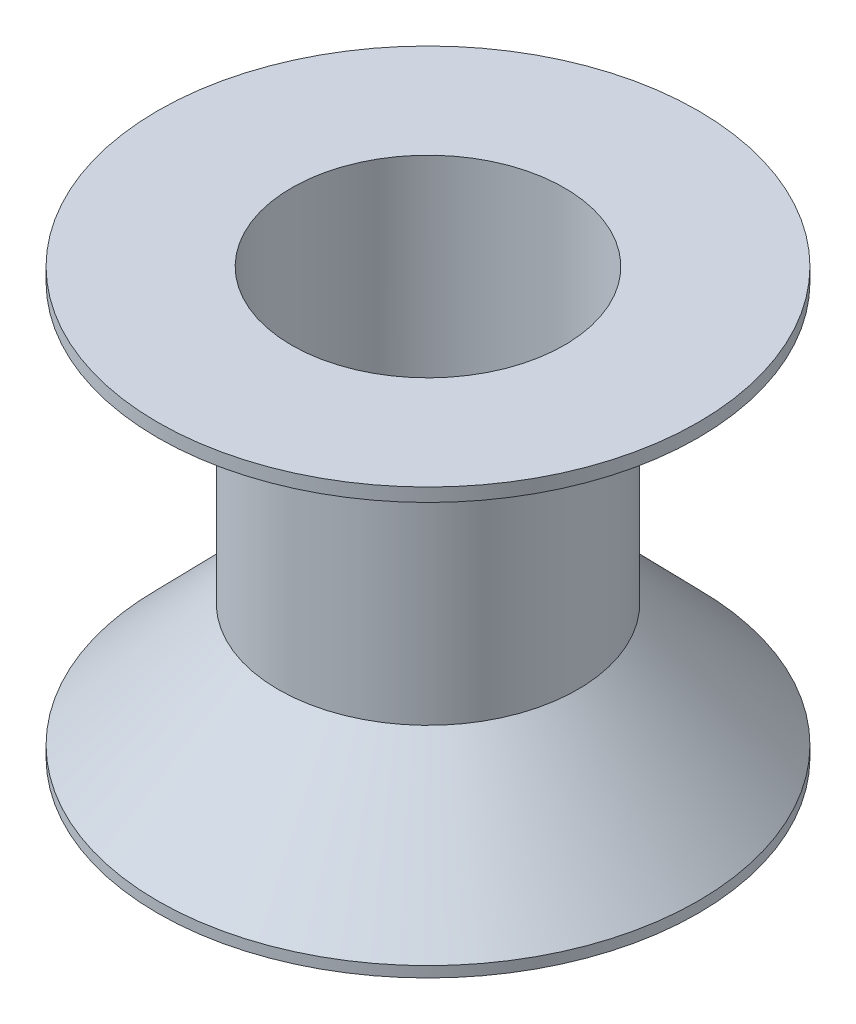
ISO-10303-21;
HEADER;
FILE_DESCRIPTION(('STEP AP214'),'2;1');
FILE_NAME('part.step','',(''),(''),'','','');
FILE_SCHEMA(('AUTOMOTIVE_DESIGN { 1 0 10303 214 1 1 1 1 }'));
ENDSEC;
DATA;
#1=APPLICATION_CONTEXT('core data for automotive mechanical design processes');
#2=APPLICATION_PROTOCOL_DEFINITION('international standard','automotive_design',2000,#1);
#3=PRODUCT_CONTEXT('',#1,'mechanical');
#4=PRODUCT('Part','Part','',(#3));
#5=PRODUCT_RELATED_PRODUCT_CATEGORY('part','',(#4));
#6=PRODUCT_DEFINITION_FORMATION('','',#4);
#7=PRODUCT_DEFINITION_CONTEXT('part definition',#1,'design');
#8=PRODUCT_DEFINITION('design','',#6,#7);
#9=PRODUCT_DEFINITION_SHAPE('','',#8);
#10=(LENGTH_UNIT() NAMED_UNIT(*) SI_UNIT(.MILLI.,.METRE.));
#11=(NAMED_UNIT(*) PLANE_ANGLE_UNIT() SI_UNIT($,.RADIAN.));
#12=(NAMED_UNIT(*) SI_UNIT($,.STERADIAN.) SOLID_ANGLE_UNIT());
#13=UNCERTAINTY_MEASURE_WITH_UNIT(LENGTH_MEASURE(1.E-05),#10,'distance_accuracy_value','');
#14=(GEOMETRIC_REPRESENTATION_CONTEXT(3) GLOBAL_UNCERTAINTY_ASSIGNED_CONTEXT((#13)) GLOBAL_UNIT_ASSIGNED_CONTEXT((#10,
#11,#12)) REPRESENTATION_CONTEXT('',''));
#15=CARTESIAN_POINT('',(0.,0.,0.));
#16=DIRECTION('',(0.,0.,1.));
#17=DIRECTION('',(1.,0.,0.));
#18=AXIS2_PLACEMENT_3D('',#15,#16,#17);
#19=CARTESIAN_POINT('',(0.,0.,0.));
#20=DIRECTION('',(0.,-1.,0.));
#21=DIRECTION('',(0.,0.,-1.));
#22=AXIS2_PLACEMENT_3D('',#19,#20,#21);
#23=PLANE('',#22);
#24=CARTESIAN_POINT('',(101.,0.,0.));
#25=DIRECTION('',(0.,1.,0.));
#26=DIRECTION('',(0.,0.,1.));
#27=AXIS2_PLACEMENT_3D('',#24,#25,#26);
#28=CIRCLE('',#27,90.73);
#29=CARTESIAN_POINT('',(101.,0.,90.73));
#30=VERTEX_POINT('',#29);
#31=EDGE_CURVE('E10',#30,#30,#28,.T.);
#32=ORIENTED_EDGE('',*,*,#31,.T.);
#33=EDGE_LOOP('',(#32));
#34=FACE_BOUND('',#33,.T.);
#35=CARTESIAN_POINT('',(101.,0.,0.));
#36=DIRECTION('',(0.,1.,0.));
#37=DIRECTION('',(0.,0.,1.));
#38=AXIS2_PLACEMENT_3D('',#35,#36,#37);
#39=CIRCLE('',#38,101.);
#40=CARTESIAN_POINT('',(101.,0.,101.));
#41=VERTEX_POINT('',#40);
#42=EDGE_CURVE('E85',#41,#41,#39,.T.);
#43=ORIENTED_EDGE('',*,*,#42,.F.);
#44=EDGE_LOOP('',(#43));
#45=FACE_BOUND('',#44,.T.);
#46=ADVANCED_FACE('F36',(#34,#45),#23,.T.);
#47=CARTESIAN_POINT('',(101.,4.,0.));
#48=DIRECTION('',(0.,1.,0.));
#49=DIRECTION('',(0.,0.,1.));
#50=AXIS2_PLACEMENT_3D('',#47,#48,#49);
#51=CYLINDRICAL_SURFACE('',#50,90.73);
#52=CARTESIAN_POINT('',(101.,4.,0.));
#53=DIRECTION('',(0.,1.,0.));
#54=DIRECTION('',(0.,0.,1.));
#55=AXIS2_PLACEMENT_3D('',#52,#53,#54);
#56=CIRCLE('',#55,90.73);
#57=CARTESIAN_POINT('',(101.,4.,90.73));
#58=VERTEX_POINT('',#57);
#59=EDGE_CURVE('E42',#58,#58,#56,.T.);
#60=ORIENTED_EDGE('',*,*,#59,.T.);
#61=EDGE_LOOP('',(#60));
#62=FACE_BOUND('',#61,.T.);
#63=ORIENTED_EDGE('',*,*,#31,.F.);
#64=EDGE_LOOP('',(#63));
#65=FACE_BOUND('',#64,.T.);
#66=ADVANCED_FACE('F133',(#62,#65),#51,.F.);
#67=CARTESIAN_POINT('',(10.27,4.,0.));
#68=DIRECTION('',(0.,-1.,0.));
#69=DIRECTION('',(0.,0.,-1.));
#70=AXIS2_PLACEMENT_3D('',#67,#68,#69);
#71=PLANE('',#70);
#72=CARTESIAN_POINT('',(101.,4.,0.));
#73=DIRECTION('',(0.,1.,0.));
#74=DIRECTION('',(0.,0.,1.));
#75=AXIS2_PLACEMENT_3D('',#72,#73,#74);
#76=CIRCLE('',#75,81.13);
#77=CARTESIAN_POINT('',(101.,4.,81.13));
#78=VERTEX_POINT('',#77);
#79=EDGE_CURVE('E46',#78,#78,#76,.T.);
#80=ORIENTED_EDGE('',*,*,#79,.T.);
#81=EDGE_LOOP('',(#80));
#82=FACE_BOUND('',#81,.T.);
#83=ORIENTED_EDGE('',*,*,#59,.F.);
#84=EDGE_LOOP('',(#83));
#85=FACE_BOUND('',#84,.T.);
#86=ADVANCED_FACE('F127',(#82,#85),#71,.T.);
#87=CARTESIAN_POINT('',(101.,4.,0.));
#88=DIRECTION('',(0.,1.,0.));
#89=DIRECTION('',(0.,0.,1.));
#90=AXIS2_PLACEMENT_3D('',#87,#88,#89);
#91=CYLINDRICAL_SURFACE('',#90,81.13);
#92=CARTESIAN_POINT('',(101.,0.,0.));
#93=DIRECTION('',(0.,1.,0.));
#94=DIRECTION('',(0.,0.,1.));
#95=AXIS2_PLACEMENT_3D('',#92,#93,#94);
#96=CIRCLE('',#95,81.13);
#97=CARTESIAN_POINT('',(101.,0.,81.13));
#98=VERTEX_POINT('',#97);
#99=EDGE_CURVE('E50',#98,#98,#96,.T.);
#100=ORIENTED_EDGE('',*,*,#99,.T.);
#101=EDGE_LOOP('',(#100));
#102=FACE_BOUND('',#101,.T.);
#103=ORIENTED_EDGE('',*,*,#79,.F.);
#104=EDGE_LOOP('',(#103));
#105=FACE_BOUND('',#104,.T.);
#106=ADVANCED_FACE('F121',(#102,#105),#91,.T.);
#107=CARTESIAN_POINT('',(19.87,0.,0.));
#108=DIRECTION('',(0.,-1.,0.));
#109=DIRECTION('',(0.,0.,-1.));
#110=AXIS2_PLACEMENT_3D('',#107,#108,#109);
#111=PLANE('',#110);
#112=CARTESIAN_POINT('',(101.,0.,0.));
#113=DIRECTION('',(0.,1.,0.));
#114=DIRECTION('',(0.,0.,1.));
#115=AXIS2_PLACEMENT_3D('',#112,#113,#114);
#116=CIRCLE('',#115,70.86);
#117=CARTESIAN_POINT('',(101.,0.,70.86));
#118=VERTEX_POINT('',#117);
#119=EDGE_CURVE('E55',#118,#118,#116,.T.);
#120=ORIENTED_EDGE('',*,*,#119,.T.);
#121=EDGE_LOOP('',(#120));
#122=FACE_BOUND('',#121,.T.);
#123=ORIENTED_EDGE('',*,*,#99,.F.);
#124=EDGE_LOOP('',(#123));
#125=FACE_BOUND('',#124,.T.);
#126=ADVANCED_FACE('F115',(#122,#125),#111,.T.);
#127=CARTESIAN_POINT('',(101.,4.,0.));
#128=DIRECTION('',(0.,1.,0.));
#129=DIRECTION('',(0.,0.,1.));
#130=AXIS2_PLACEMENT_3D('',#127,#128,#129);
#131=CYLINDRICAL_SURFACE('',#130,70.86);
#132=CARTESIAN_POINT('',(101.,4.,0.));
#133=DIRECTION('',(0.,1.,0.));
#134=DIRECTION('',(0.,0.,1.));
#135=AXIS2_PLACEMENT_3D('',#132,#133,#134);
#136=CIRCLE('',#135,70.86);
#137=CARTESIAN_POINT('',(101.,4.,70.86));
#138=VERTEX_POINT('',#137);
#139=EDGE_CURVE('E58',#138,#138,#136,.T.);
#140=ORIENTED_EDGE('',*,*,#139,.T.);
#141=EDGE_LOOP('',(#140));
#142=FACE_BOUND('',#141,.T.);
#143=ORIENTED_EDGE('',*,*,#119,.F.);
#144=EDGE_LOOP('',(#143));
#145=FACE_BOUND('',#144,.T.);
#146=ADVANCED_FACE('F109',(#142,#145),#131,.F.);
#147=CARTESIAN_POINT('',(30.14,4.,0.));
#148=DIRECTION('',(0.,-1.,0.));
#149=DIRECTION('',(0.,0.,-1.));
#150=AXIS2_PLACEMENT_3D('',#147,#148,#149);
#151=PLANE('',#150);
#152=CARTESIAN_POINT('',(101.,4.,0.));
#153=DIRECTION('',(0.,1.,0.));
#154=DIRECTION('',(0.,0.,1.));
#155=AXIS2_PLACEMENT_3D('',#152,#153,#154);
#156=CIRCLE('',#155,61.26);
#157=CARTESIAN_POINT('',(101.,4.,61.26));
#158=VERTEX_POINT('',#157);
#159=EDGE_CURVE('E61',#158,#158,#156,.T.);
#160=ORIENTED_EDGE('',*,*,#159,.T.);
#161=EDGE_LOOP('',(#160));
#162=FACE_BOUND('',#161,.T.);
#163=ORIENTED_EDGE('',*,*,#139,.F.);
#164=EDGE_LOOP('',(#163));
#165=FACE_BOUND('',#164,.T.);
#166=ADVANCED_FACE('F103',(#162,#165),#151,.T.);
#167=CARTESIAN_POINT('',(101.,4.,0.));
#168=DIRECTION('',(0.,1.,0.));
#169=DIRECTION('',(0.,0.,1.));
#170=AXIS2_PLACEMENT_3D('',#167,#168,#169);
#171=CYLINDRICAL_SURFACE('',#170,61.26);
#172=CARTESIAN_POINT('',(101.,0.,0.));
#173=DIRECTION('',(0.,1.,0.));
#174=DIRECTION('',(0.,0.,1.));
#175=AXIS2_PLACEMENT_3D('',#172,#173,#174);
#176=CIRCLE('',#175,61.26);
#177=CARTESIAN_POINT('',(101.,0.,61.26));
#178=VERTEX_POINT('',#177);
#179=EDGE_CURVE('E64',#178,#178,#176,.T.);
#180=ORIENTED_EDGE('',*,*,#179,.T.);
#181=EDGE_LOOP('',(#180));
#182=FACE_BOUND('',#181,.T.);
#183=ORIENTED_EDGE('',*,*,#159,.F.);
#184=EDGE_LOOP('',(#183));
#185=FACE_BOUND('',#184,.T.);
#186=ADVANCED_FACE('F97',(#182,#185),#171,.T.);
#187=CARTESIAN_POINT('',(101.,0.,0.));
#188=DIRECTION('',(0.,-1.,0.));
#189=DIRECTION('',(0.,0.,-1.));
#190=AXIS2_PLACEMENT_3D('',#187,#188,#189);
#191=PLANE('',#190);
#192=CARTESIAN_POINT('',(101.,0.,0.));
#193=DIRECTION('',(0.,-1.,0.));
#194=DIRECTION('',(0.,0.,-1.));
#195=AXIS2_PLACEMENT_3D('',#192,#193,#194);
#196=CIRCLE('',#195,51.);
#197=CARTESIAN_POINT('',(101.,0.,-51.));
#198=VERTEX_POINT('',#197);
#199=EDGE_CURVE('E88',#198,#198,#196,.T.);
#200=ORIENTED_EDGE('',*,*,#199,.F.);
#201=EDGE_LOOP('',(#200));
#202=FACE_BOUND('',#201,.T.);
#203=ORIENTED_EDGE('',*,*,#179,.F.);
#204=EDGE_LOOP('',(#203));
#205=FACE_BOUND('',#204,.T.);
#206=ADVANCED_FACE('F94',(#202,#205),#191,.T.);
#207=CARTESIAN_POINT('',(101.,4.,0.));
#208=DIRECTION('',(0.,1.,0.));
#209=DIRECTION('',(0.,0.,1.));
#210=AXIS2_PLACEMENT_3D('',#207,#208,#209);
#211=CYLINDRICAL_SURFACE('',#210,51.);
#212=CARTESIAN_POINT('',(101.,159.,0.));
#213=DIRECTION('',(0.,1.,0.));
#214=DIRECTION('',(0.,0.,1.));
#215=AXIS2_PLACEMENT_3D('',#212,#213,#214);
#216=CIRCLE('',#215,51.);
#217=CARTESIAN_POINT('',(101.,159.,51.));
#218=VERTEX_POINT('',#217);
#219=EDGE_CURVE('E67',#218,#218,#216,.T.);
#220=ORIENTED_EDGE('',*,*,#219,.T.);
#221=EDGE_LOOP('',(#220));
#222=FACE_BOUND('',#221,.T.);
#223=ORIENTED_EDGE('',*,*,#199,.T.);
#224=EDGE_LOOP('',(#223));
#225=FACE_BOUND('',#224,.T.);
#226=ADVANCED_FACE('F92',(#222,#225),#211,.F.);
#227=CARTESIAN_POINT('',(50.,159.,0.));
#228=DIRECTION('',(0.,1.,0.));
#229=DIRECTION('',(0.,0.,1.));
#230=AXIS2_PLACEMENT_3D('',#227,#228,#229);
#231=PLANE('',#230);
#232=CARTESIAN_POINT('',(101.,159.,0.));
#233=DIRECTION('',(0.,1.,0.));
#234=DIRECTION('',(0.,0.,1.));
#235=AXIS2_PLACEMENT_3D('',#232,#233,#234);
#236=CIRCLE('',#235,101.);
#237=CARTESIAN_POINT('',(101.,159.,101.));
#238=VERTEX_POINT('',#237);
#239=EDGE_CURVE('E70',#238,#238,#236,.T.);
#240=ORIENTED_EDGE('',*,*,#239,.T.);
#241=EDGE_LOOP('',(#240));
#242=FACE_BOUND('',#241,.T.);
#243=ORIENTED_EDGE('',*,*,#219,.F.);
#244=EDGE_LOOP('',(#243));
#245=FACE_BOUND('',#244,.T.);
#246=ADVANCED_FACE('F171',(#242,#245),#231,.T.);
#247=CARTESIAN_POINT('',(101.,4.,0.));
#248=DIRECTION('',(0.,1.,0.));
#249=DIRECTION('',(0.,0.,1.));
#250=AXIS2_PLACEMENT_3D('',#247,#248,#249);
#251=CYLINDRICAL_SURFACE('',#250,101.);
#252=CARTESIAN_POINT('',(101.,154.,0.));
#253=DIRECTION('',(0.,1.,0.));
#254=DIRECTION('',(0.,0.,1.));
#255=AXIS2_PLACEMENT_3D('',#252,#253,#254);
#256=CIRCLE('',#255,101.);
#257=CARTESIAN_POINT('',(101.,154.,101.));
#258=VERTEX_POINT('',#257);
#259=EDGE_CURVE('E73',#258,#258,#256,.T.);
#260=ORIENTED_EDGE('',*,*,#259,.T.);
#261=EDGE_LOOP('',(#260));
#262=FACE_BOUND('',#261,.T.);
#263=ORIENTED_EDGE('',*,*,#239,.F.);
#264=EDGE_LOOP('',(#263));
#265=FACE_BOUND('',#264,.T.);
#266=ADVANCED_FACE('F165',(#262,#265),#251,.T.);
#267=CARTESIAN_POINT('',(0.,154.,0.));
#268=DIRECTION('',(0.,-1.,0.));
#269=DIRECTION('',(0.,0.,-1.));
#270=AXIS2_PLACEMENT_3D('',#267,#268,#269);
#271=PLANE('',#270);
#272=CARTESIAN_POINT('',(101.,154.,0.));
#273=DIRECTION('',(0.,1.,0.));
#274=DIRECTION('',(0.,0.,1.));
#275=AXIS2_PLACEMENT_3D('',#272,#273,#274);
#276=CIRCLE('',#275,56.);
#277=CARTESIAN_POINT('',(101.,154.,56.));
#278=VERTEX_POINT('',#277);
#279=EDGE_CURVE('E76',#278,#278,#276,.T.);
#280=ORIENTED_EDGE('',*,*,#279,.T.);
#281=EDGE_LOOP('',(#280));
#282=FACE_BOUND('',#281,.T.);
#283=ORIENTED_EDGE('',*,*,#259,.F.);
#284=EDGE_LOOP('',(#283));
#285=FACE_BOUND('',#284,.T.);
#286=ADVANCED_FACE('F159',(#282,#285),#271,.T.);
#287=CARTESIAN_POINT('',(101.,4.,0.));
#288=DIRECTION('',(0.,1.,0.));
#289=DIRECTION('',(0.,0.,1.));
#290=AXIS2_PLACEMENT_3D('',#287,#288,#289);
#291=CYLINDRICAL_SURFACE('',#290,56.);
#292=CARTESIAN_POINT('',(101.,50.,0.));
#293=DIRECTION('',(0.,1.,0.));
#294=DIRECTION('',(0.,0.,1.));
#295=AXIS2_PLACEMENT_3D('',#292,#293,#294);
#296=CIRCLE('',#295,56.);
#297=CARTESIAN_POINT('',(101.,50.,56.));
#298=VERTEX_POINT('',#297);
#299=EDGE_CURVE('E79',#298,#298,#296,.T.);
#300=ORIENTED_EDGE('',*,*,#299,.T.);
#301=EDGE_LOOP('',(#300));
#302=FACE_BOUND('',#301,.T.);
#303=ORIENTED_EDGE('',*,*,#279,.F.);
#304=EDGE_LOOP('',(#303));
#305=FACE_BOUND('',#304,.T.);
#306=ADVANCED_FACE('F153',(#302,#305),#291,.T.);
#307=CARTESIAN_POINT('',(101.,50.,0.));
#308=DIRECTION('',(0.,-1.,0.));
#309=DIRECTION('',(0.,0.,-1.));
#310=AXIS2_PLACEMENT_3D('',#307,#308,#309);
#311=CONICAL_SURFACE('',#310,56.,0.774409594714714);
#312=CARTESIAN_POINT('',(101.,4.,0.));
#313=DIRECTION('',(0.,1.,0.));
#314=DIRECTION('',(0.,0.,1.));
#315=AXIS2_PLACEMENT_3D('',#312,#313,#314);
#316=CIRCLE('',#315,101.);
#317=CARTESIAN_POINT('',(101.,4.,101.));
#318=VERTEX_POINT('',#317);
#319=EDGE_CURVE('E82',#318,#318,#316,.T.);
#320=ORIENTED_EDGE('',*,*,#319,.T.);
#321=EDGE_LOOP('',(#320));
#322=FACE_BOUND('',#321,.T.);
#323=ORIENTED_EDGE('',*,*,#299,.F.);
#324=EDGE_LOOP('',(#323));
#325=FACE_BOUND('',#324,.T.);
#326=ADVANCED_FACE('F147',(#322,#325),#311,.T.);
#327=CARTESIAN_POINT('',(101.,4.,0.));
#328=DIRECTION('',(0.,1.,0.));
#329=DIRECTION('',(0.,0.,1.));
#330=AXIS2_PLACEMENT_3D('',#327,#328,#329);
#331=CYLINDRICAL_SURFACE('',#330,101.);
#332=ORIENTED_EDGE('',*,*,#42,.T.);
#333=EDGE_LOOP('',(#332));
#334=FACE_BOUND('',#333,.T.);
#335=ORIENTED_EDGE('',*,*,#319,.F.);
#336=EDGE_LOOP('',(#335));
#337=FACE_BOUND('',#336,.T.);
#338=ADVANCED_FACE('F144',(#334,#337),#331,.T.);
#339=CLOSED_SHELL('',(#46,#66,#86,#106,#126,#146,#166,#186,#206,#226,#246,#266,#286,#306,#326,#338));
#340=MANIFOLD_SOLID_BREP('B2',#339);
#341=ADVANCED_BREP_SHAPE_REPRESENTATION('',(#18,#340),#14);
#342=SHAPE_DEFINITION_REPRESENTATION(#9,#341);
ENDSEC;
END-ISO-10303-21;
